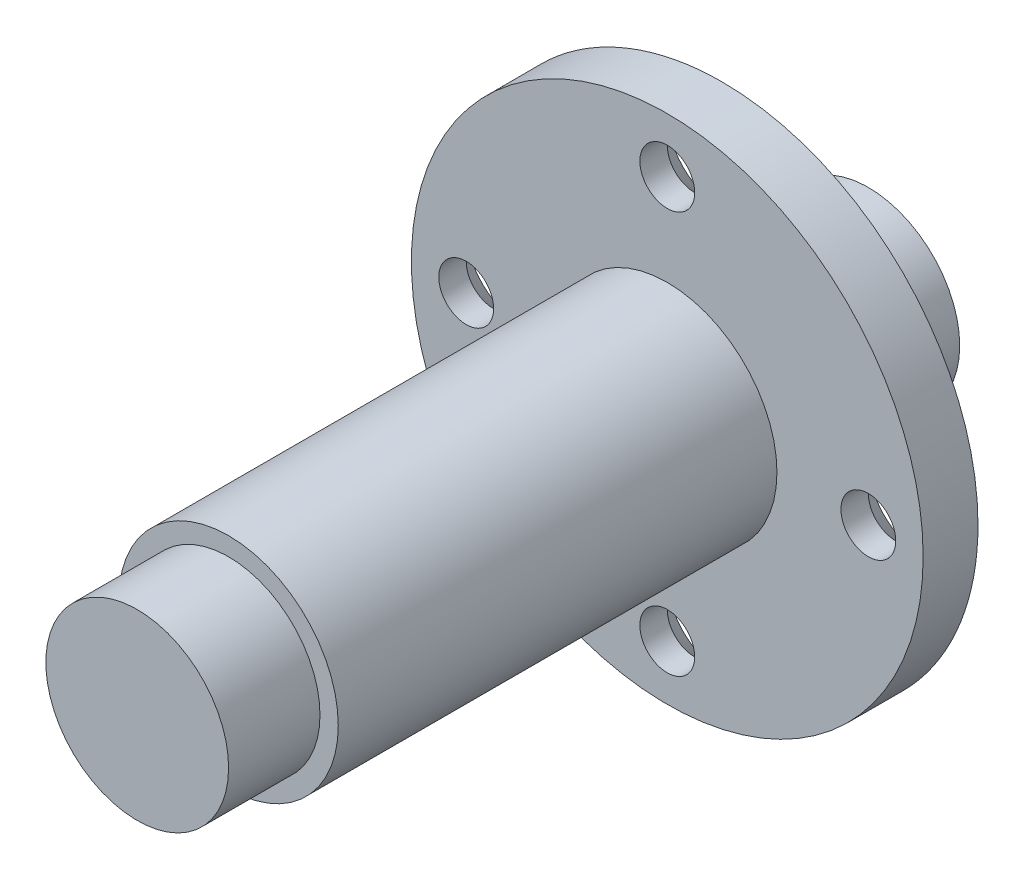
ISO-10303-21;
HEADER;
FILE_DESCRIPTION(('STEP AP214'),'2;1');
FILE_NAME('part.step','',(''),(''),'','','');
FILE_SCHEMA(('AUTOMOTIVE_DESIGN { 1 0 10303 214 1 1 1 1 }'));
ENDSEC;
DATA;
#1=APPLICATION_CONTEXT('core data for automotive mechanical design processes');
#2=APPLICATION_PROTOCOL_DEFINITION('international standard','automotive_design',2000,#1);
#3=PRODUCT_CONTEXT('',#1,'mechanical');
#4=PRODUCT('Part','Part','',(#3));
#5=PRODUCT_RELATED_PRODUCT_CATEGORY('part','',(#4));
#6=PRODUCT_DEFINITION_FORMATION('','',#4);
#7=PRODUCT_DEFINITION_CONTEXT('part definition',#1,'design');
#8=PRODUCT_DEFINITION('design','',#6,#7);
#9=PRODUCT_DEFINITION_SHAPE('','',#8);
#10=(LENGTH_UNIT() NAMED_UNIT(*) SI_UNIT(.MILLI.,.METRE.));
#11=(NAMED_UNIT(*) PLANE_ANGLE_UNIT() SI_UNIT($,.RADIAN.));
#12=(NAMED_UNIT(*) SI_UNIT($,.STERADIAN.) SOLID_ANGLE_UNIT());
#13=UNCERTAINTY_MEASURE_WITH_UNIT(LENGTH_MEASURE(1.E-05),#10,'distance_accuracy_value','');
#14=(GEOMETRIC_REPRESENTATION_CONTEXT(3) GLOBAL_UNCERTAINTY_ASSIGNED_CONTEXT((#13)) GLOBAL_UNIT_ASSIGNED_CONTEXT((#10,
#11,#12)) REPRESENTATION_CONTEXT('',''));
#15=CARTESIAN_POINT('',(0.,0.,0.));
#16=DIRECTION('',(0.,0.,1.));
#17=DIRECTION('',(1.,0.,0.));
#18=AXIS2_PLACEMENT_3D('',#15,#16,#17);
#19=CARTESIAN_POINT('',(0.,0.,5.));
#20=DIRECTION('',(0.,0.,-1.));
#21=DIRECTION('',(-1.,0.,0.));
#22=AXIS2_PLACEMENT_3D('',#19,#20,#21);
#23=CYLINDRICAL_SURFACE('',#22,5.);
#24=CARTESIAN_POINT('',(0.,0.,5.));
#25=DIRECTION('',(0.,0.,1.));
#26=DIRECTION('',(1.,0.,0.));
#27=AXIS2_PLACEMENT_3D('',#24,#25,#26);
#28=CIRCLE('',#27,5.);
#29=CARTESIAN_POINT('',(5.,0.,5.));
#30=VERTEX_POINT('',#29);
#31=EDGE_CURVE('E185',#30,#30,#28,.T.);
#32=ORIENTED_EDGE('',*,*,#31,.F.);
#33=EDGE_LOOP('',(#32));
#34=FACE_BOUND('',#33,.T.);
#35=CARTESIAN_POINT('',(0.,0.,0.));
#36=DIRECTION('',(0.,0.,1.));
#37=DIRECTION('',(1.,0.,0.));
#38=AXIS2_PLACEMENT_3D('',#35,#36,#37);
#39=CIRCLE('',#38,5.);
#40=CARTESIAN_POINT('',(5.,0.,0.));
#41=VERTEX_POINT('',#40);
#42=EDGE_CURVE('E200',#41,#41,#39,.T.);
#43=ORIENTED_EDGE('',*,*,#42,.T.);
#44=EDGE_LOOP('',(#43));
#45=FACE_BOUND('',#44,.T.);
#46=ADVANCED_FACE('F41',(#34,#45),#23,.T.);
#47=CARTESIAN_POINT('',(0.,0.,0.));
#48=DIRECTION('',(0.,0.,1.));
#49=DIRECTION('',(1.,0.,0.));
#50=AXIS2_PLACEMENT_3D('',#47,#48,#49);
#51=PLANE('',#50);
#52=ORIENTED_EDGE('',*,*,#42,.F.);
#53=EDGE_LOOP('',(#52));
#54=FACE_BOUND('',#53,.T.);
#55=ADVANCED_FACE('F114',(#54),#51,.F.);
#56=CARTESIAN_POINT('',(0.,0.,8.));
#57=DIRECTION('',(0.,0.,-1.));
#58=DIRECTION('',(-1.,0.,0.));
#59=AXIS2_PLACEMENT_3D('',#56,#57,#58);
#60=CYLINDRICAL_SURFACE('',#59,7.);
#61=CARTESIAN_POINT('',(0.,0.,8.));
#62=DIRECTION('',(0.,0.,1.));
#63=DIRECTION('',(1.,0.,0.));
#64=AXIS2_PLACEMENT_3D('',#61,#62,#63);
#65=CIRCLE('',#64,7.);
#66=CARTESIAN_POINT('',(7.,0.,8.));
#67=VERTEX_POINT('',#66);
#68=EDGE_CURVE('E196',#67,#67,#65,.T.);
#69=ORIENTED_EDGE('',*,*,#68,.F.);
#70=EDGE_LOOP('',(#69));
#71=FACE_BOUND('',#70,.T.);
#72=CARTESIAN_POINT('',(0.,0.,5.));
#73=DIRECTION('',(0.,0.,1.));
#74=DIRECTION('',(1.,0.,0.));
#75=AXIS2_PLACEMENT_3D('',#72,#73,#74);
#76=CIRCLE('',#75,7.);
#77=CARTESIAN_POINT('',(7.,0.,5.));
#78=VERTEX_POINT('',#77);
#79=EDGE_CURVE('E190',#78,#78,#76,.T.);
#80=ORIENTED_EDGE('',*,*,#79,.T.);
#81=EDGE_LOOP('',(#80));
#82=FACE_BOUND('',#81,.T.);
#83=ADVANCED_FACE('F120',(#71,#82),#60,.T.);
#84=CARTESIAN_POINT('',(0.,0.,5.));
#85=DIRECTION('',(0.,0.,1.));
#86=DIRECTION('',(1.,0.,0.));
#87=AXIS2_PLACEMENT_3D('',#84,#85,#86);
#88=PLANE('',#87);
#89=ORIENTED_EDGE('',*,*,#31,.T.);
#90=EDGE_LOOP('',(#89));
#91=FACE_BOUND('',#90,.T.);
#92=ORIENTED_EDGE('',*,*,#79,.F.);
#93=EDGE_LOOP('',(#92));
#94=FACE_BOUND('',#93,.T.);
#95=ADVANCED_FACE('F237',(#91,#94),#88,.F.);
#96=CARTESIAN_POINT('',(0.,0.,11.));
#97=DIRECTION('',(0.,0.,-1.));
#98=DIRECTION('',(-1.,0.,0.));
#99=AXIS2_PLACEMENT_3D('',#96,#97,#98);
#100=CYLINDRICAL_SURFACE('',#99,14.);
#101=CARTESIAN_POINT('',(0.,0.,11.));
#102=DIRECTION('',(0.,0.,1.));
#103=DIRECTION('',(1.,0.,0.));
#104=AXIS2_PLACEMENT_3D('',#101,#102,#103);
#105=CIRCLE('',#104,14.);
#106=CARTESIAN_POINT('',(14.,0.,11.));
#107=VERTEX_POINT('',#106);
#108=EDGE_CURVE('E186',#107,#107,#105,.T.);
#109=ORIENTED_EDGE('',*,*,#108,.F.);
#110=EDGE_LOOP('',(#109));
#111=FACE_BOUND('',#110,.T.);
#112=CARTESIAN_POINT('',(0.,0.,8.));
#113=DIRECTION('',(0.,0.,1.));
#114=DIRECTION('',(1.,0.,0.));
#115=AXIS2_PLACEMENT_3D('',#112,#113,#114);
#116=CIRCLE('',#115,14.);
#117=CARTESIAN_POINT('',(14.,0.,8.));
#118=VERTEX_POINT('',#117);
#119=CARTESIAN_POINT('',(-1.46642216231412E-13,14.,8.));
#120=VERTEX_POINT('',#119);
#121=EDGE_CURVE('E191',#118,#120,#116,.T.);
#122=ORIENTED_EDGE('',*,*,#121,.T.);
#123=CARTESIAN_POINT('',(-14.,0.,8.));
#124=VERTEX_POINT('',#123);
#125=EDGE_CURVE('E195',#120,#124,#116,.T.);
#126=ORIENTED_EDGE('',*,*,#125,.T.);
#127=CARTESIAN_POINT('',(0.,-14.,8.));
#128=VERTEX_POINT('',#127);
#129=EDGE_CURVE('E212',#124,#128,#116,.T.);
#130=ORIENTED_EDGE('',*,*,#129,.T.);
#131=EDGE_CURVE('E181',#128,#118,#116,.T.);
#132=ORIENTED_EDGE('',*,*,#131,.T.);
#133=EDGE_LOOP('',(#122,#126,#130,#132));
#134=FACE_BOUND('',#133,.T.);
#135=ADVANCED_FACE('F216',(#111,#134),#100,.T.);
#136=CARTESIAN_POINT('',(0.,0.,11.));
#137=DIRECTION('',(0.,0.,1.));
#138=DIRECTION('',(1.,0.,0.));
#139=AXIS2_PLACEMENT_3D('',#136,#137,#138);
#140=PLANE('',#139);
#141=CARTESIAN_POINT('',(-11.,0.,11.));
#142=DIRECTION('',(0.,0.,1.));
#143=DIRECTION('',(1.,0.,0.));
#144=AXIS2_PLACEMENT_3D('',#141,#142,#143);
#145=CIRCLE('',#144,1.5);
#146=CARTESIAN_POINT('',(-9.5,0.,11.));
#147=VERTEX_POINT('',#146);
#148=EDGE_CURVE('E157',#147,#147,#145,.T.);
#149=ORIENTED_EDGE('',*,*,#148,.F.);
#150=EDGE_LOOP('',(#149));
#151=FACE_BOUND('',#150,.T.);
#152=CARTESIAN_POINT('',(0.,-11.,11.));
#153=DIRECTION('',(0.,0.,1.));
#154=DIRECTION('',(1.,0.,0.));
#155=AXIS2_PLACEMENT_3D('',#152,#153,#154);
#156=CIRCLE('',#155,1.5);
#157=CARTESIAN_POINT('',(1.50000000000004,-11.,11.));
#158=VERTEX_POINT('',#157);
#159=EDGE_CURVE('E154',#158,#158,#156,.T.);
#160=ORIENTED_EDGE('',*,*,#159,.F.);
#161=EDGE_LOOP('',(#160));
#162=FACE_BOUND('',#161,.T.);
#163=CARTESIAN_POINT('',(11.,0.,11.));
#164=DIRECTION('',(0.,0.,1.));
#165=DIRECTION('',(1.,0.,0.));
#166=AXIS2_PLACEMENT_3D('',#163,#164,#165);
#167=CIRCLE('',#166,1.5);
#168=CARTESIAN_POINT('',(12.5,0.,11.));
#169=VERTEX_POINT('',#168);
#170=EDGE_CURVE('E158',#169,#169,#167,.T.);
#171=ORIENTED_EDGE('',*,*,#170,.F.);
#172=EDGE_LOOP('',(#171));
#173=FACE_BOUND('',#172,.T.);
#174=CARTESIAN_POINT('',(-1.15218884181823E-13,11.,11.));
#175=DIRECTION('',(0.,0.,1.));
#176=DIRECTION('',(1.,0.,0.));
#177=AXIS2_PLACEMENT_3D('',#174,#175,#176);
#178=CIRCLE('',#177,1.5);
#179=CARTESIAN_POINT('',(1.49999999999989,11.,11.));
#180=VERTEX_POINT('',#179);
#181=EDGE_CURVE('E166',#180,#180,#178,.T.);
#182=ORIENTED_EDGE('',*,*,#181,.F.);
#183=EDGE_LOOP('',(#182));
#184=FACE_BOUND('',#183,.T.);
#185=CARTESIAN_POINT('',(0.,0.,11.));
#186=DIRECTION('',(0.,0.,1.));
#187=DIRECTION('',(1.,0.,0.));
#188=AXIS2_PLACEMENT_3D('',#185,#186,#187);
#189=CIRCLE('',#188,6.);
#190=CARTESIAN_POINT('',(6.,0.,11.));
#191=VERTEX_POINT('',#190);
#192=EDGE_CURVE('E177',#191,#191,#189,.T.);
#193=ORIENTED_EDGE('',*,*,#192,.F.);
#194=EDGE_LOOP('',(#193));
#195=FACE_BOUND('',#194,.T.);
#196=ORIENTED_EDGE('',*,*,#108,.T.);
#197=EDGE_LOOP('',(#196));
#198=FACE_BOUND('',#197,.T.);
#199=ADVANCED_FACE('F222',(#151,#162,#173,#184,#195,#198),#140,.T.);
#200=CARTESIAN_POINT('',(0.,0.,8.));
#201=DIRECTION('',(0.,0.,1.));
#202=DIRECTION('',(1.,0.,0.));
#203=AXIS2_PLACEMENT_3D('',#200,#201,#202);
#204=PLANE('',#203);
#205=ORIENTED_EDGE('',*,*,#68,.T.);
#206=EDGE_LOOP('',(#205));
#207=FACE_BOUND('',#206,.T.);
#208=ORIENTED_EDGE('',*,*,#131,.F.);
#209=CARTESIAN_POINT('',(0.,-11.,8.));
#210=DIRECTION('',(0.,0.,1.));
#211=DIRECTION('',(1.,0.,0.));
#212=AXIS2_PLACEMENT_3D('',#209,#210,#211);
#213=CIRCLE('',#212,3.);
#214=EDGE_CURVE('E56',#128,#128,#213,.T.);
#215=ORIENTED_EDGE('',*,*,#214,.T.);
#216=ORIENTED_EDGE('',*,*,#129,.F.);
#217=CARTESIAN_POINT('',(-11.,0.,8.));
#218=DIRECTION('',(0.,0.,1.));
#219=DIRECTION('',(1.,0.,0.));
#220=AXIS2_PLACEMENT_3D('',#217,#218,#219);
#221=CIRCLE('',#220,3.);
#222=EDGE_CURVE('E61',#124,#124,#221,.T.);
#223=ORIENTED_EDGE('',*,*,#222,.T.);
#224=ORIENTED_EDGE('',*,*,#125,.F.);
#225=CARTESIAN_POINT('',(-1.15218884181823E-13,11.,8.));
#226=DIRECTION('',(0.,0.,1.));
#227=DIRECTION('',(1.,0.,0.));
#228=AXIS2_PLACEMENT_3D('',#225,#226,#227);
#229=CIRCLE('',#228,3.00000000000002);
#230=EDGE_CURVE('E76',#120,#120,#229,.T.);
#231=ORIENTED_EDGE('',*,*,#230,.T.);
#232=ORIENTED_EDGE('',*,*,#121,.F.);
#233=CARTESIAN_POINT('',(11.,0.,8.));
#234=DIRECTION('',(0.,0.,1.));
#235=DIRECTION('',(1.,0.,0.));
#236=AXIS2_PLACEMENT_3D('',#233,#234,#235);
#237=CIRCLE('',#236,3.);
#238=EDGE_CURVE('E69',#118,#118,#237,.T.);
#239=ORIENTED_EDGE('',*,*,#238,.T.);
#240=EDGE_LOOP('',(#208,#215,#216,#223,#224,#231,#232,#239));
#241=FACE_BOUND('',#240,.T.);
#242=ADVANCED_FACE('F218',(#207,#241),#204,.F.);
#243=CARTESIAN_POINT('',(0.,0.,35.));
#244=DIRECTION('',(0.,0.,-1.));
#245=DIRECTION('',(-1.,0.,0.));
#246=AXIS2_PLACEMENT_3D('',#243,#244,#245);
#247=CYLINDRICAL_SURFACE('',#246,6.);
#248=CARTESIAN_POINT('',(0.,0.,35.));
#249=DIRECTION('',(0.,0.,1.));
#250=DIRECTION('',(1.,0.,0.));
#251=AXIS2_PLACEMENT_3D('',#248,#249,#250);
#252=CIRCLE('',#251,6.);
#253=CARTESIAN_POINT('',(6.,0.,35.));
#254=VERTEX_POINT('',#253);
#255=EDGE_CURVE('E173',#254,#254,#252,.T.);
#256=ORIENTED_EDGE('',*,*,#255,.F.);
#257=EDGE_LOOP('',(#256));
#258=FACE_BOUND('',#257,.T.);
#259=ORIENTED_EDGE('',*,*,#192,.T.);
#260=EDGE_LOOP('',(#259));
#261=FACE_BOUND('',#260,.T.);
#262=ADVANCED_FACE('F221',(#258,#261),#247,.T.);
#263=CARTESIAN_POINT('',(0.,0.,35.));
#264=DIRECTION('',(0.,0.,1.));
#265=DIRECTION('',(1.,0.,0.));
#266=AXIS2_PLACEMENT_3D('',#263,#264,#265);
#267=PLANE('',#266);
#268=CARTESIAN_POINT('',(0.,0.,35.));
#269=DIRECTION('',(0.,0.,1.));
#270=DIRECTION('',(1.,0.,0.));
#271=AXIS2_PLACEMENT_3D('',#268,#269,#270);
#272=CIRCLE('',#271,5.);
#273=CARTESIAN_POINT('',(5.,0.,35.));
#274=VERTEX_POINT('',#273);
#275=EDGE_CURVE('E84',#274,#274,#272,.T.);
#276=ORIENTED_EDGE('',*,*,#275,.F.);
#277=EDGE_LOOP('',(#276));
#278=FACE_BOUND('',#277,.T.);
#279=ORIENTED_EDGE('',*,*,#255,.T.);
#280=EDGE_LOOP('',(#279));
#281=FACE_BOUND('',#280,.T.);
#282=ADVANCED_FACE('F229',(#278,#281),#267,.T.);
#283=CARTESIAN_POINT('',(0.,0.,40.));
#284=DIRECTION('',(0.,0.,-1.));
#285=DIRECTION('',(-1.,0.,0.));
#286=AXIS2_PLACEMENT_3D('',#283,#284,#285);
#287=CYLINDRICAL_SURFACE('',#286,5.);
#288=CARTESIAN_POINT('',(0.,0.,40.));
#289=DIRECTION('',(0.,0.,1.));
#290=DIRECTION('',(1.,0.,0.));
#291=AXIS2_PLACEMENT_3D('',#288,#289,#290);
#292=CIRCLE('',#291,5.);
#293=CARTESIAN_POINT('',(5.,0.,40.));
#294=VERTEX_POINT('',#293);
#295=EDGE_CURVE('E163',#294,#294,#292,.T.);
#296=ORIENTED_EDGE('',*,*,#295,.F.);
#297=EDGE_LOOP('',(#296));
#298=FACE_BOUND('',#297,.T.);
#299=ORIENTED_EDGE('',*,*,#275,.T.);
#300=EDGE_LOOP('',(#299));
#301=FACE_BOUND('',#300,.T.);
#302=ADVANCED_FACE('F275',(#298,#301),#287,.T.);
#303=CARTESIAN_POINT('',(0.,0.,40.));
#304=DIRECTION('',(0.,0.,1.));
#305=DIRECTION('',(1.,0.,0.));
#306=AXIS2_PLACEMENT_3D('',#303,#304,#305);
#307=PLANE('',#306);
#308=ORIENTED_EDGE('',*,*,#295,.T.);
#309=EDGE_LOOP('',(#308));
#310=FACE_BOUND('',#309,.T.);
#311=ADVANCED_FACE('F270',(#310),#307,.T.);
#312=CARTESIAN_POINT('',(-1.15218884181823E-13,11.,13.));
#313=DIRECTION('',(0.,0.,-1.));
#314=DIRECTION('',(-1.,0.,0.));
#315=AXIS2_PLACEMENT_3D('',#312,#313,#314);
#316=CYLINDRICAL_SURFACE('',#315,1.5);
#317=CARTESIAN_POINT('',(-1.15218884181823E-13,11.,9.50000000000001));
#318=DIRECTION('',(0.,0.,1.));
#319=DIRECTION('',(1.,0.,0.));
#320=AXIS2_PLACEMENT_3D('',#317,#318,#319);
#321=CIRCLE('',#320,1.5);
#322=CARTESIAN_POINT('',(1.49999999999989,11.,9.50000000000001));
#323=VERTEX_POINT('',#322);
#324=EDGE_CURVE('E51',#323,#323,#321,.F.);
#325=ORIENTED_EDGE('',*,*,#324,.T.);
#326=EDGE_LOOP('',(#325));
#327=FACE_BOUND('',#326,.T.);
#328=ORIENTED_EDGE('',*,*,#181,.T.);
#329=EDGE_LOOP('',(#328));
#330=FACE_BOUND('',#329,.T.);
#331=ADVANCED_FACE('F99',(#327,#330),#316,.F.);
#332=CARTESIAN_POINT('',(11.,0.,13.));
#333=DIRECTION('',(0.,0.,-1.));
#334=DIRECTION('',(-1.,0.,0.));
#335=AXIS2_PLACEMENT_3D('',#332,#333,#334);
#336=CYLINDRICAL_SURFACE('',#335,1.5);
#337=CARTESIAN_POINT('',(11.,0.,9.5));
#338=DIRECTION('',(0.,0.,1.));
#339=DIRECTION('',(1.,0.,0.));
#340=AXIS2_PLACEMENT_3D('',#337,#338,#339);
#341=CIRCLE('',#340,1.5);
#342=CARTESIAN_POINT('',(12.5,0.,9.5));
#343=VERTEX_POINT('',#342);
#344=EDGE_CURVE('E11',#343,#343,#341,.F.);
#345=ORIENTED_EDGE('',*,*,#344,.T.);
#346=EDGE_LOOP('',(#345));
#347=FACE_BOUND('',#346,.T.);
#348=ORIENTED_EDGE('',*,*,#170,.T.);
#349=EDGE_LOOP('',(#348));
#350=FACE_BOUND('',#349,.T.);
#351=ADVANCED_FACE('F150',(#347,#350),#336,.F.);
#352=CARTESIAN_POINT('',(0.,-11.,13.));
#353=DIRECTION('',(0.,0.,-1.));
#354=DIRECTION('',(-1.,0.,0.));
#355=AXIS2_PLACEMENT_3D('',#352,#353,#354);
#356=CYLINDRICAL_SURFACE('',#355,1.5);
#357=CARTESIAN_POINT('',(0.,-11.,9.5));
#358=DIRECTION('',(0.,0.,1.));
#359=DIRECTION('',(1.,0.,0.));
#360=AXIS2_PLACEMENT_3D('',#357,#358,#359);
#361=CIRCLE('',#360,1.5);
#362=CARTESIAN_POINT('',(1.50000000000004,-11.,9.5));
#363=VERTEX_POINT('',#362);
#364=EDGE_CURVE('E77',#363,#363,#361,.F.);
#365=ORIENTED_EDGE('',*,*,#364,.T.);
#366=EDGE_LOOP('',(#365));
#367=FACE_BOUND('',#366,.T.);
#368=ORIENTED_EDGE('',*,*,#159,.T.);
#369=EDGE_LOOP('',(#368));
#370=FACE_BOUND('',#369,.T.);
#371=ADVANCED_FACE('F142',(#367,#370),#356,.F.);
#372=CARTESIAN_POINT('',(-11.,0.,13.));
#373=DIRECTION('',(0.,0.,-1.));
#374=DIRECTION('',(-1.,0.,0.));
#375=AXIS2_PLACEMENT_3D('',#372,#373,#374);
#376=CYLINDRICAL_SURFACE('',#375,1.5);
#377=CARTESIAN_POINT('',(-11.,0.,9.5));
#378=DIRECTION('',(0.,0.,1.));
#379=DIRECTION('',(1.,0.,0.));
#380=AXIS2_PLACEMENT_3D('',#377,#378,#379);
#381=CIRCLE('',#380,1.5);
#382=CARTESIAN_POINT('',(-9.5,0.,9.5));
#383=VERTEX_POINT('',#382);
#384=EDGE_CURVE('E92',#383,#383,#381,.F.);
#385=ORIENTED_EDGE('',*,*,#384,.T.);
#386=EDGE_LOOP('',(#385));
#387=FACE_BOUND('',#386,.T.);
#388=ORIENTED_EDGE('',*,*,#148,.T.);
#389=EDGE_LOOP('',(#388));
#390=FACE_BOUND('',#389,.T.);
#391=ADVANCED_FACE('F132',(#387,#390),#376,.F.);
#392=CARTESIAN_POINT('',(0.,-11.,9.5));
#393=DIRECTION('',(0.,0.,-1.));
#394=DIRECTION('',(-1.,0.,0.));
#395=AXIS2_PLACEMENT_3D('',#392,#393,#394);
#396=CONICAL_SURFACE('',#395,1.5,0.785398163397449);
#397=ORIENTED_EDGE('',*,*,#214,.F.);
#398=EDGE_LOOP('',(#397));
#399=FACE_BOUND('',#398,.T.);
#400=ORIENTED_EDGE('',*,*,#364,.F.);
#401=EDGE_LOOP('',(#400));
#402=FACE_BOUND('',#401,.T.);
#403=ADVANCED_FACE('F110',(#399,#402),#396,.F.);
#404=CARTESIAN_POINT('',(-11.,0.,9.5));
#405=DIRECTION('',(0.,0.,-1.));
#406=DIRECTION('',(-1.,0.,0.));
#407=AXIS2_PLACEMENT_3D('',#404,#405,#406);
#408=CONICAL_SURFACE('',#407,1.5,0.785398163397449);
#409=ORIENTED_EDGE('',*,*,#222,.F.);
#410=EDGE_LOOP('',(#409));
#411=FACE_BOUND('',#410,.T.);
#412=ORIENTED_EDGE('',*,*,#384,.F.);
#413=EDGE_LOOP('',(#412));
#414=FACE_BOUND('',#413,.T.);
#415=ADVANCED_FACE('F104',(#411,#414),#408,.F.);
#416=CARTESIAN_POINT('',(-1.15218884181823E-13,11.,9.50000000000001));
#417=DIRECTION('',(0.,0.,-1.));
#418=DIRECTION('',(-1.,0.,0.));
#419=AXIS2_PLACEMENT_3D('',#416,#417,#418);
#420=CONICAL_SURFACE('',#419,1.5,0.785398163397451);
#421=ORIENTED_EDGE('',*,*,#230,.F.);
#422=EDGE_LOOP('',(#421));
#423=FACE_BOUND('',#422,.T.);
#424=ORIENTED_EDGE('',*,*,#324,.F.);
#425=EDGE_LOOP('',(#424));
#426=FACE_BOUND('',#425,.T.);
#427=ADVANCED_FACE('F102',(#423,#426),#420,.F.);
#428=CARTESIAN_POINT('',(11.,0.,9.5));
#429=DIRECTION('',(0.,0.,-1.));
#430=DIRECTION('',(-1.,0.,0.));
#431=AXIS2_PLACEMENT_3D('',#428,#429,#430);
#432=CONICAL_SURFACE('',#431,1.5,0.785398163397449);
#433=ORIENTED_EDGE('',*,*,#238,.F.);
#434=EDGE_LOOP('',(#433));
#435=FACE_BOUND('',#434,.T.);
#436=ORIENTED_EDGE('',*,*,#344,.F.);
#437=EDGE_LOOP('',(#436));
#438=FACE_BOUND('',#437,.T.);
#439=ADVANCED_FACE('F44',(#435,#438),#432,.F.);
#440=CLOSED_SHELL('',(#46,#55,#83,#95,#135,#199,#242,#262,#282,#302,#311,#331,#351,#371,#391,
#403,#415,#427,#439));
#441=MANIFOLD_SOLID_BREP('B2',#440);
#442=ADVANCED_BREP_SHAPE_REPRESENTATION('',(#18,#441),#14);
#443=SHAPE_DEFINITION_REPRESENTATION(#9,#442);
ENDSEC;
END-ISO-10303-21;
